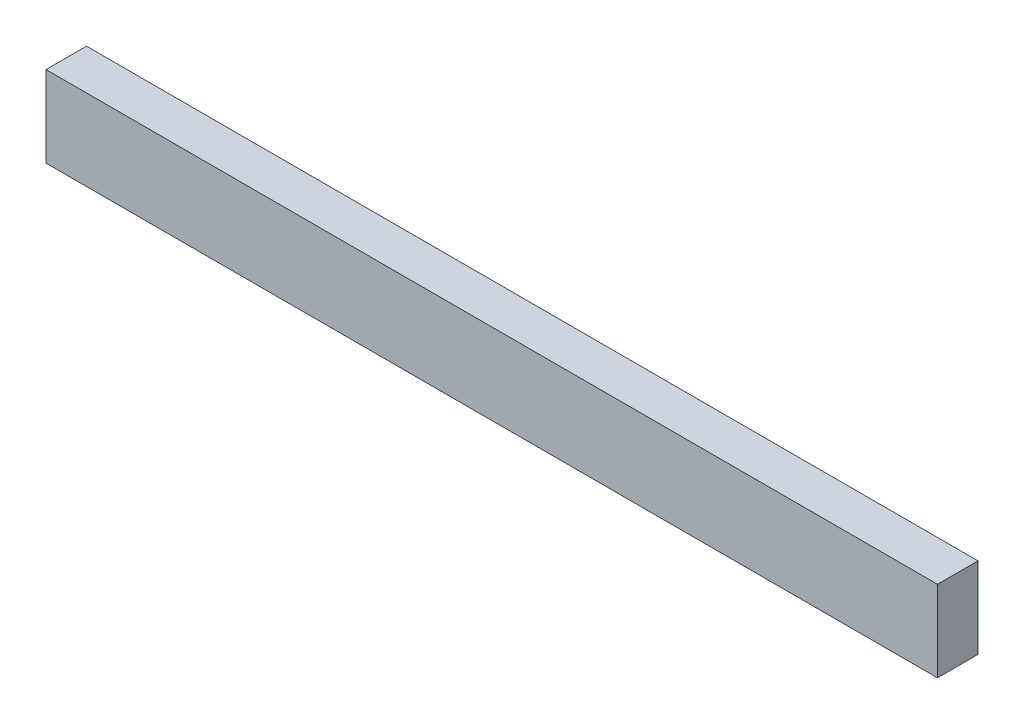
ISO-10303-21;
HEADER;
FILE_DESCRIPTION(('STEP AP214'),'2;1');
FILE_NAME('part.step','',(''),(''),'','','');
FILE_SCHEMA(('AUTOMOTIVE_DESIGN { 1 0 10303 214 1 1 1 1 }'));
ENDSEC;
DATA;
#1=APPLICATION_CONTEXT('core data for automotive mechanical design processes');
#2=APPLICATION_PROTOCOL_DEFINITION('international standard','automotive_design',2000,#1);
#3=PRODUCT_CONTEXT('',#1,'mechanical');
#4=PRODUCT('Part','Part','',(#3));
#5=PRODUCT_RELATED_PRODUCT_CATEGORY('part','',(#4));
#6=PRODUCT_DEFINITION_FORMATION('','',#4);
#7=PRODUCT_DEFINITION_CONTEXT('part definition',#1,'design');
#8=PRODUCT_DEFINITION('design','',#6,#7);
#9=PRODUCT_DEFINITION_SHAPE('','',#8);
#10=(LENGTH_UNIT() NAMED_UNIT(*) SI_UNIT(.MILLI.,.METRE.));
#11=(NAMED_UNIT(*) PLANE_ANGLE_UNIT() SI_UNIT($,.RADIAN.));
#12=(NAMED_UNIT(*) SI_UNIT($,.STERADIAN.) SOLID_ANGLE_UNIT());
#13=UNCERTAINTY_MEASURE_WITH_UNIT(LENGTH_MEASURE(1.E-05),#10,'distance_accuracy_value','');
#14=(GEOMETRIC_REPRESENTATION_CONTEXT(3) GLOBAL_UNCERTAINTY_ASSIGNED_CONTEXT((#13)) GLOBAL_UNIT_ASSIGNED_CONTEXT((#10,
#11,#12)) REPRESENTATION_CONTEXT('',''));
#15=CARTESIAN_POINT('',(0.,0.,0.));
#16=DIRECTION('',(0.,0.,1.));
#17=DIRECTION('',(1.,0.,0.));
#18=AXIS2_PLACEMENT_3D('',#15,#16,#17);
#19=CARTESIAN_POINT('',(110.,-10.,10.));
#20=DIRECTION('',(-1.,0.,0.));
#21=DIRECTION('',(0.,0.,1.));
#22=AXIS2_PLACEMENT_3D('',#19,#20,#21);
#23=PLANE('',#22);
#24=DIRECTION('',(0.,1.,0.));
#25=VECTOR('',#24,1.);
#26=CARTESIAN_POINT('',(110.,-10.,0.));
#27=LINE('',#26,#25);
#28=CARTESIAN_POINT('',(110.,-10.,0.));
#29=VERTEX_POINT('',#28);
#30=CARTESIAN_POINT('',(110.,10.,0.));
#31=VERTEX_POINT('',#30);
#32=EDGE_CURVE('E96',#29,#31,#27,.T.);
#33=ORIENTED_EDGE('',*,*,#32,.T.);
#34=DIRECTION('',(0.,0.,-1.));
#35=VECTOR('',#34,1.);
#36=CARTESIAN_POINT('',(110.,10.,10.));
#37=LINE('',#36,#35);
#38=CARTESIAN_POINT('',(110.,10.,10.));
#39=VERTEX_POINT('',#38);
#40=EDGE_CURVE('E11',#39,#31,#37,.T.);
#41=ORIENTED_EDGE('',*,*,#40,.F.);
#42=DIRECTION('',(0.,1.,0.));
#43=VECTOR('',#42,1.);
#44=CARTESIAN_POINT('',(110.,-10.,10.));
#45=LINE('',#44,#43);
#46=CARTESIAN_POINT('',(110.,-10.,10.));
#47=VERTEX_POINT('',#46);
#48=EDGE_CURVE('E84',#47,#39,#45,.T.);
#49=ORIENTED_EDGE('',*,*,#48,.F.);
#50=DIRECTION('',(0.,0.,-1.));
#51=VECTOR('',#50,1.);
#52=CARTESIAN_POINT('',(110.,-10.,10.));
#53=LINE('',#52,#51);
#54=EDGE_CURVE('E92',#47,#29,#53,.T.);
#55=ORIENTED_EDGE('',*,*,#54,.T.);
#56=EDGE_LOOP('',(#33,#41,#49,#55));
#57=FACE_BOUND('',#56,.T.);
#58=ADVANCED_FACE('F33',(#57),#23,.F.);
#59=CARTESIAN_POINT('',(-110.,10.,10.));
#60=DIRECTION('',(0.,-1.,0.));
#61=DIRECTION('',(0.,0.,-1.));
#62=AXIS2_PLACEMENT_3D('',#59,#60,#61);
#63=PLANE('',#62);
#64=DIRECTION('',(-1.,0.,0.));
#65=VECTOR('',#64,1.);
#66=CARTESIAN_POINT('',(-110.,10.,0.));
#67=LINE('',#66,#65);
#68=CARTESIAN_POINT('',(-110.,10.,0.));
#69=VERTEX_POINT('',#68);
#70=EDGE_CURVE('E88',#31,#69,#67,.T.);
#71=ORIENTED_EDGE('',*,*,#70,.T.);
#72=DIRECTION('',(0.,0.,-1.));
#73=VECTOR('',#72,1.);
#74=CARTESIAN_POINT('',(-110.,10.,10.));
#75=LINE('',#74,#73);
#76=CARTESIAN_POINT('',(-110.,10.,10.));
#77=VERTEX_POINT('',#76);
#78=EDGE_CURVE('E41',#77,#69,#75,.T.);
#79=ORIENTED_EDGE('',*,*,#78,.F.);
#80=DIRECTION('',(-1.,0.,0.));
#81=VECTOR('',#80,1.);
#82=CARTESIAN_POINT('',(-110.,10.,10.));
#83=LINE('',#82,#81);
#84=EDGE_CURVE('E79',#39,#77,#83,.T.);
#85=ORIENTED_EDGE('',*,*,#84,.F.);
#86=ORIENTED_EDGE('',*,*,#40,.T.);
#87=EDGE_LOOP('',(#71,#79,#85,#86));
#88=FACE_BOUND('',#87,.T.);
#89=ADVANCED_FACE('F87',(#88),#63,.F.);
#90=CARTESIAN_POINT('',(-110.,-10.,10.));
#91=DIRECTION('',(1.,0.,0.));
#92=DIRECTION('',(0.,0.,-1.));
#93=AXIS2_PLACEMENT_3D('',#90,#91,#92);
#94=PLANE('',#93);
#95=DIRECTION('',(0.,-1.,0.));
#96=VECTOR('',#95,1.);
#97=CARTESIAN_POINT('',(-110.,-10.,0.));
#98=LINE('',#97,#96);
#99=CARTESIAN_POINT('',(-110.,-10.,0.));
#100=VERTEX_POINT('',#99);
#101=EDGE_CURVE('E66',#69,#100,#98,.T.);
#102=ORIENTED_EDGE('',*,*,#101,.T.);
#103=DIRECTION('',(0.,0.,-1.));
#104=VECTOR('',#103,1.);
#105=CARTESIAN_POINT('',(-110.,-10.,10.));
#106=LINE('',#105,#104);
#107=CARTESIAN_POINT('',(-110.,-10.,10.));
#108=VERTEX_POINT('',#107);
#109=EDGE_CURVE('E89',#108,#100,#106,.T.);
#110=ORIENTED_EDGE('',*,*,#109,.F.);
#111=DIRECTION('',(0.,-1.,0.));
#112=VECTOR('',#111,1.);
#113=CARTESIAN_POINT('',(-110.,-10.,10.));
#114=LINE('',#113,#112);
#115=EDGE_CURVE('E82',#77,#108,#114,.T.);
#116=ORIENTED_EDGE('',*,*,#115,.F.);
#117=ORIENTED_EDGE('',*,*,#78,.T.);
#118=EDGE_LOOP('',(#102,#110,#116,#117));
#119=FACE_BOUND('',#118,.T.);
#120=ADVANCED_FACE('F90',(#119),#94,.F.);
#121=CARTESIAN_POINT('',(-110.,-10.,10.));
#122=DIRECTION('',(0.,1.,0.));
#123=DIRECTION('',(0.,0.,1.));
#124=AXIS2_PLACEMENT_3D('',#121,#122,#123);
#125=PLANE('',#124);
#126=DIRECTION('',(1.,0.,0.));
#127=VECTOR('',#126,1.);
#128=CARTESIAN_POINT('',(-110.,-10.,0.));
#129=LINE('',#128,#127);
#130=EDGE_CURVE('E72',#100,#29,#129,.T.);
#131=ORIENTED_EDGE('',*,*,#130,.T.);
#132=ORIENTED_EDGE('',*,*,#54,.F.);
#133=DIRECTION('',(1.,0.,0.));
#134=VECTOR('',#133,1.);
#135=CARTESIAN_POINT('',(-110.,-10.,10.));
#136=LINE('',#135,#134);
#137=EDGE_CURVE('E49',#108,#47,#136,.T.);
#138=ORIENTED_EDGE('',*,*,#137,.F.);
#139=ORIENTED_EDGE('',*,*,#109,.T.);
#140=EDGE_LOOP('',(#131,#132,#138,#139));
#141=FACE_BOUND('',#140,.T.);
#142=ADVANCED_FACE('F103',(#141),#125,.F.);
#143=CARTESIAN_POINT('',(0.,0.,10.));
#144=DIRECTION('',(0.,0.,-1.));
#145=DIRECTION('',(-1.,0.,0.));
#146=AXIS2_PLACEMENT_3D('',#143,#144,#145);
#147=PLANE('',#146);
#148=ORIENTED_EDGE('',*,*,#48,.T.);
#149=ORIENTED_EDGE('',*,*,#84,.T.);
#150=ORIENTED_EDGE('',*,*,#115,.T.);
#151=ORIENTED_EDGE('',*,*,#137,.T.);
#152=EDGE_LOOP('',(#148,#149,#150,#151));
#153=FACE_BOUND('',#152,.T.);
#154=ADVANCED_FACE('F80',(#153),#147,.F.);
#155=CARTESIAN_POINT('',(0.,0.,0.));
#156=DIRECTION('',(0.,0.,-1.));
#157=DIRECTION('',(-1.,0.,0.));
#158=AXIS2_PLACEMENT_3D('',#155,#156,#157);
#159=PLANE('',#158);
#160=ORIENTED_EDGE('',*,*,#32,.F.);
#161=ORIENTED_EDGE('',*,*,#130,.F.);
#162=ORIENTED_EDGE('',*,*,#101,.F.);
#163=ORIENTED_EDGE('',*,*,#70,.F.);
#164=EDGE_LOOP('',(#160,#161,#162,#163));
#165=FACE_BOUND('',#164,.T.);
#166=ADVANCED_FACE('F106',(#165),#159,.T.);
#167=CLOSED_SHELL('',(#58,#89,#120,#142,#154,#166));
#168=MANIFOLD_SOLID_BREP('B2',#167);
#169=ADVANCED_BREP_SHAPE_REPRESENTATION('',(#18,#168),#14);
#170=SHAPE_DEFINITION_REPRESENTATION(#9,#169);
ENDSEC;
END-ISO-10303-21;
